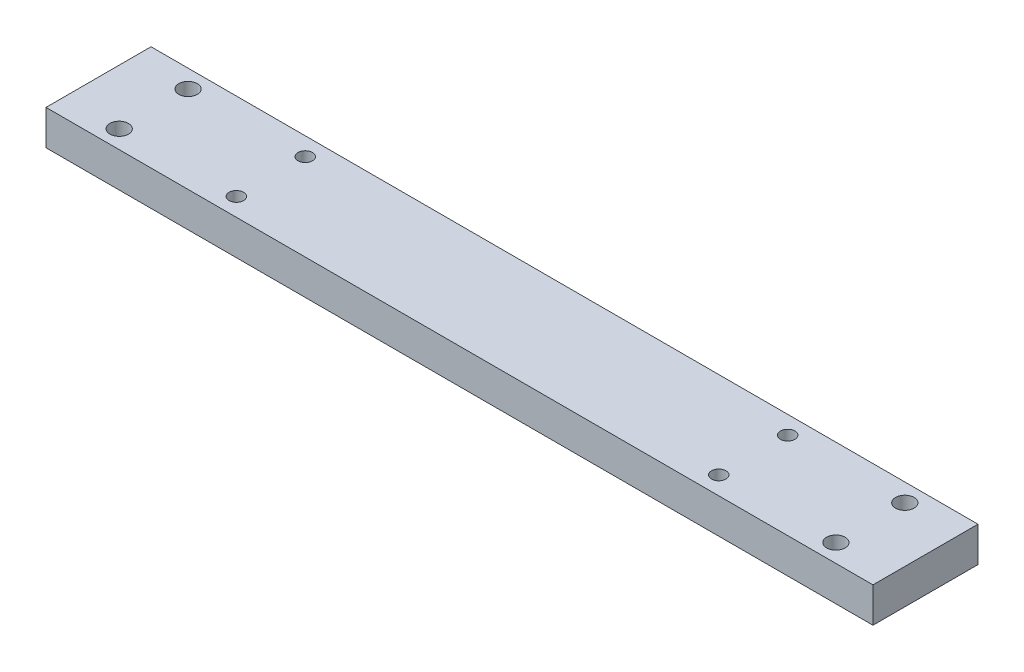
ISO-10303-21;
HEADER;
FILE_DESCRIPTION(('STEP AP214'),'2;1');
FILE_NAME('part.step','',(''),(''),'','','');
FILE_SCHEMA(('AUTOMOTIVE_DESIGN { 1 0 10303 214 1 1 1 1 }'));
ENDSEC;
DATA;
#1=APPLICATION_CONTEXT('core data for automotive mechanical design processes');
#2=APPLICATION_PROTOCOL_DEFINITION('international standard','automotive_design',2000,#1);
#3=PRODUCT_CONTEXT('',#1,'mechanical');
#4=PRODUCT('Part','Part','',(#3));
#5=PRODUCT_RELATED_PRODUCT_CATEGORY('part','',(#4));
#6=PRODUCT_DEFINITION_FORMATION('','',#4);
#7=PRODUCT_DEFINITION_CONTEXT('part definition',#1,'design');
#8=PRODUCT_DEFINITION('design','',#6,#7);
#9=PRODUCT_DEFINITION_SHAPE('','',#8);
#10=(LENGTH_UNIT() NAMED_UNIT(*) SI_UNIT(.MILLI.,.METRE.));
#11=(NAMED_UNIT(*) PLANE_ANGLE_UNIT() SI_UNIT($,.RADIAN.));
#12=(NAMED_UNIT(*) SI_UNIT($,.STERADIAN.) SOLID_ANGLE_UNIT());
#13=UNCERTAINTY_MEASURE_WITH_UNIT(LENGTH_MEASURE(1.E-05),#10,'distance_accuracy_value','');
#14=(GEOMETRIC_REPRESENTATION_CONTEXT(3) GLOBAL_UNCERTAINTY_ASSIGNED_CONTEXT((#13)) GLOBAL_UNIT_ASSIGNED_CONTEXT((#10,
#11,#12)) REPRESENTATION_CONTEXT('',''));
#15=CARTESIAN_POINT('',(0.,0.,0.));
#16=DIRECTION('',(0.,0.,1.));
#17=DIRECTION('',(1.,0.,0.));
#18=AXIS2_PLACEMENT_3D('',#15,#16,#17);
#19=CARTESIAN_POINT('',(0.,25.4,0.));
#20=DIRECTION('',(1.,0.,0.));
#21=DIRECTION('',(0.,0.,-1.));
#22=AXIS2_PLACEMENT_3D('',#19,#20,#21);
#23=PLANE('',#22);
#24=DIRECTION('',(0.,0.,1.));
#25=VECTOR('',#24,1.);
#26=CARTESIAN_POINT('',(0.,0.,0.));
#27=LINE('',#26,#25);
#28=CARTESIAN_POINT('',(0.,0.,-76.2));
#29=VERTEX_POINT('',#28);
#30=CARTESIAN_POINT('',(0.,0.,0.));
#31=VERTEX_POINT('',#30);
#32=EDGE_CURVE('E96',#29,#31,#27,.T.);
#33=ORIENTED_EDGE('',*,*,#32,.T.);
#34=DIRECTION('',(0.,-1.,0.));
#35=VECTOR('',#34,1.);
#36=CARTESIAN_POINT('',(0.,25.4,0.));
#37=LINE('',#36,#35);
#38=CARTESIAN_POINT('',(0.,25.4,0.));
#39=VERTEX_POINT('',#38);
#40=EDGE_CURVE('E11',#39,#31,#37,.T.);
#41=ORIENTED_EDGE('',*,*,#40,.F.);
#42=DIRECTION('',(0.,0.,1.));
#43=VECTOR('',#42,1.);
#44=CARTESIAN_POINT('',(0.,25.4,0.));
#45=LINE('',#44,#43);
#46=CARTESIAN_POINT('',(0.,25.4,-76.2));
#47=VERTEX_POINT('',#46);
#48=EDGE_CURVE('E84',#47,#39,#45,.T.);
#49=ORIENTED_EDGE('',*,*,#48,.F.);
#50=DIRECTION('',(0.,-1.,0.));
#51=VECTOR('',#50,1.);
#52=CARTESIAN_POINT('',(0.,25.4,-76.2));
#53=LINE('',#52,#51);
#54=EDGE_CURVE('E92',#47,#29,#53,.T.);
#55=ORIENTED_EDGE('',*,*,#54,.T.);
#56=EDGE_LOOP('',(#33,#41,#49,#55));
#57=FACE_BOUND('',#56,.T.);
#58=ADVANCED_FACE('F33',(#57),#23,.F.);
#59=CARTESIAN_POINT('',(0.,25.4,0.));
#60=DIRECTION('',(0.,0.,-1.));
#61=DIRECTION('',(-1.,0.,0.));
#62=AXIS2_PLACEMENT_3D('',#59,#60,#61);
#63=PLANE('',#62);
#64=DIRECTION('',(1.,0.,0.));
#65=VECTOR('',#64,1.);
#66=CARTESIAN_POINT('',(0.,0.,0.));
#67=LINE('',#66,#65);
#68=CARTESIAN_POINT('',(600.,0.,0.));
#69=VERTEX_POINT('',#68);
#70=EDGE_CURVE('E88',#31,#69,#67,.T.);
#71=ORIENTED_EDGE('',*,*,#70,.T.);
#72=DIRECTION('',(0.,-1.,0.));
#73=VECTOR('',#72,1.);
#74=CARTESIAN_POINT('',(600.,25.4,0.));
#75=LINE('',#74,#73);
#76=CARTESIAN_POINT('',(600.,25.4,0.));
#77=VERTEX_POINT('',#76);
#78=EDGE_CURVE('E41',#77,#69,#75,.T.);
#79=ORIENTED_EDGE('',*,*,#78,.F.);
#80=DIRECTION('',(1.,0.,0.));
#81=VECTOR('',#80,1.);
#82=CARTESIAN_POINT('',(0.,25.4,0.));
#83=LINE('',#82,#81);
#84=EDGE_CURVE('E79',#39,#77,#83,.T.);
#85=ORIENTED_EDGE('',*,*,#84,.F.);
#86=ORIENTED_EDGE('',*,*,#40,.T.);
#87=EDGE_LOOP('',(#71,#79,#85,#86));
#88=FACE_BOUND('',#87,.T.);
#89=ADVANCED_FACE('F87',(#88),#63,.F.);
#90=CARTESIAN_POINT('',(600.,25.4,0.));
#91=DIRECTION('',(-1.,0.,0.));
#92=DIRECTION('',(0.,0.,1.));
#93=AXIS2_PLACEMENT_3D('',#90,#91,#92);
#94=PLANE('',#93);
#95=DIRECTION('',(0.,0.,-1.));
#96=VECTOR('',#95,1.);
#97=CARTESIAN_POINT('',(600.,0.,0.));
#98=LINE('',#97,#96);
#99=CARTESIAN_POINT('',(600.,0.,-76.2));
#100=VERTEX_POINT('',#99);
#101=EDGE_CURVE('E66',#69,#100,#98,.T.);
#102=ORIENTED_EDGE('',*,*,#101,.T.);
#103=DIRECTION('',(0.,-1.,0.));
#104=VECTOR('',#103,1.);
#105=CARTESIAN_POINT('',(600.,25.4,-76.2));
#106=LINE('',#105,#104);
#107=CARTESIAN_POINT('',(600.,25.4,-76.2));
#108=VERTEX_POINT('',#107);
#109=EDGE_CURVE('E89',#108,#100,#106,.T.);
#110=ORIENTED_EDGE('',*,*,#109,.F.);
#111=DIRECTION('',(0.,0.,-1.));
#112=VECTOR('',#111,1.);
#113=CARTESIAN_POINT('',(600.,25.4,0.));
#114=LINE('',#113,#112);
#115=EDGE_CURVE('E82',#77,#108,#114,.T.);
#116=ORIENTED_EDGE('',*,*,#115,.F.);
#117=ORIENTED_EDGE('',*,*,#78,.T.);
#118=EDGE_LOOP('',(#102,#110,#116,#117));
#119=FACE_BOUND('',#118,.T.);
#120=ADVANCED_FACE('F90',(#119),#94,.F.);
#121=CARTESIAN_POINT('',(0.,25.4,-76.2));
#122=DIRECTION('',(0.,0.,1.));
#123=DIRECTION('',(1.,0.,0.));
#124=AXIS2_PLACEMENT_3D('',#121,#122,#123);
#125=PLANE('',#124);
#126=DIRECTION('',(-1.,0.,0.));
#127=VECTOR('',#126,1.);
#128=CARTESIAN_POINT('',(0.,0.,-76.2));
#129=LINE('',#128,#127);
#130=EDGE_CURVE('E72',#100,#29,#129,.T.);
#131=ORIENTED_EDGE('',*,*,#130,.T.);
#132=ORIENTED_EDGE('',*,*,#54,.F.);
#133=DIRECTION('',(-1.,0.,0.));
#134=VECTOR('',#133,1.);
#135=CARTESIAN_POINT('',(0.,25.4,-76.2));
#136=LINE('',#135,#134);
#137=EDGE_CURVE('E49',#108,#47,#136,.T.);
#138=ORIENTED_EDGE('',*,*,#137,.F.);
#139=ORIENTED_EDGE('',*,*,#109,.T.);
#140=EDGE_LOOP('',(#131,#132,#138,#139));
#141=FACE_BOUND('',#140,.T.);
#142=ADVANCED_FACE('F104',(#141),#125,.F.);
#143=CARTESIAN_POINT('',(0.,25.4,-76.2));
#144=DIRECTION('',(0.,-1.,0.));
#145=DIRECTION('',(0.,0.,-1.));
#146=AXIS2_PLACEMENT_3D('',#143,#144,#145);
#147=PLANE('',#146);
#148=CARTESIAN_POINT('',(475.,25.4,-63.1));
#149=DIRECTION('',(0.,1.,0.));
#150=DIRECTION('',(0.,0.,1.));
#151=AXIS2_PLACEMENT_3D('',#148,#149,#150);
#152=CIRCLE('',#151,5.25);
#153=CARTESIAN_POINT('',(475.,25.4,-57.85));
#154=VERTEX_POINT('',#153);
#155=EDGE_CURVE('E149',#154,#154,#152,.T.);
#156=ORIENTED_EDGE('',*,*,#155,.F.);
#157=EDGE_LOOP('',(#156));
#158=FACE_BOUND('',#157,.T.);
#159=CARTESIAN_POINT('',(475.,25.4,-13.1));
#160=DIRECTION('',(0.,1.,0.));
#161=DIRECTION('',(0.,0.,1.));
#162=AXIS2_PLACEMENT_3D('',#159,#160,#161);
#163=CIRCLE('',#162,5.25000000000001);
#164=CARTESIAN_POINT('',(475.,25.4,-7.84999999999999));
#165=VERTEX_POINT('',#164);
#166=EDGE_CURVE('E143',#165,#165,#163,.T.);
#167=ORIENTED_EDGE('',*,*,#166,.F.);
#168=EDGE_LOOP('',(#167));
#169=FACE_BOUND('',#168,.T.);
#170=CARTESIAN_POINT('',(125.,25.4,-13.1));
#171=DIRECTION('',(0.,1.,0.));
#172=DIRECTION('',(0.,0.,1.));
#173=AXIS2_PLACEMENT_3D('',#170,#171,#172);
#174=CIRCLE('',#173,5.25);
#175=CARTESIAN_POINT('',(125.,25.4,-7.84999999999999));
#176=VERTEX_POINT('',#175);
#177=EDGE_CURVE('E137',#176,#176,#174,.T.);
#178=ORIENTED_EDGE('',*,*,#177,.F.);
#179=EDGE_LOOP('',(#178));
#180=FACE_BOUND('',#179,.T.);
#181=CARTESIAN_POINT('',(125.,25.4,-63.1));
#182=DIRECTION('',(0.,1.,0.));
#183=DIRECTION('',(0.,0.,1.));
#184=AXIS2_PLACEMENT_3D('',#181,#182,#183);
#185=CIRCLE('',#184,5.25000000000003);
#186=CARTESIAN_POINT('',(125.,25.4,-57.85));
#187=VERTEX_POINT('',#186);
#188=EDGE_CURVE('E134',#187,#187,#185,.T.);
#189=ORIENTED_EDGE('',*,*,#188,.F.);
#190=EDGE_LOOP('',(#189));
#191=FACE_BOUND('',#190,.T.);
#192=CARTESIAN_POINT('',(39.9999999999999,25.4,-63.1));
#193=DIRECTION('',(0.,1.,0.));
#194=DIRECTION('',(0.,0.,1.));
#195=AXIS2_PLACEMENT_3D('',#192,#193,#194);
#196=CIRCLE('',#195,6.75);
#197=CARTESIAN_POINT('',(39.9999999999999,25.4,-56.35));
#198=VERTEX_POINT('',#197);
#199=EDGE_CURVE('E125',#198,#198,#196,.T.);
#200=ORIENTED_EDGE('',*,*,#199,.F.);
#201=EDGE_LOOP('',(#200));
#202=FACE_BOUND('',#201,.T.);
#203=CARTESIAN_POINT('',(39.9999999999999,25.4,-13.1));
#204=DIRECTION('',(0.,1.,0.));
#205=DIRECTION('',(0.,0.,1.));
#206=AXIS2_PLACEMENT_3D('',#203,#204,#205);
#207=CIRCLE('',#206,6.75);
#208=CARTESIAN_POINT('',(39.9999999999999,25.4,-6.34999999999997));
#209=VERTEX_POINT('',#208);
#210=EDGE_CURVE('E119',#209,#209,#207,.T.);
#211=ORIENTED_EDGE('',*,*,#210,.F.);
#212=EDGE_LOOP('',(#211));
#213=FACE_BOUND('',#212,.T.);
#214=CARTESIAN_POINT('',(560.,25.4,-63.1));
#215=DIRECTION('',(0.,1.,0.));
#216=DIRECTION('',(0.,0.,1.));
#217=AXIS2_PLACEMENT_3D('',#214,#215,#216);
#218=CIRCLE('',#217,6.75000000000003);
#219=CARTESIAN_POINT('',(560.,25.4,-56.35));
#220=VERTEX_POINT('',#219);
#221=EDGE_CURVE('E113',#220,#220,#218,.T.);
#222=ORIENTED_EDGE('',*,*,#221,.F.);
#223=EDGE_LOOP('',(#222));
#224=FACE_BOUND('',#223,.T.);
#225=CARTESIAN_POINT('',(560.,25.4,-13.1));
#226=DIRECTION('',(0.,1.,0.));
#227=DIRECTION('',(0.,0.,1.));
#228=AXIS2_PLACEMENT_3D('',#225,#226,#227);
#229=CIRCLE('',#228,6.75000000000003);
#230=CARTESIAN_POINT('',(560.,25.4,-6.34999999999997));
#231=VERTEX_POINT('',#230);
#232=EDGE_CURVE('E110',#231,#231,#229,.T.);
#233=ORIENTED_EDGE('',*,*,#232,.F.);
#234=EDGE_LOOP('',(#233));
#235=FACE_BOUND('',#234,.T.);
#236=ORIENTED_EDGE('',*,*,#48,.T.);
#237=ORIENTED_EDGE('',*,*,#84,.T.);
#238=ORIENTED_EDGE('',*,*,#115,.T.);
#239=ORIENTED_EDGE('',*,*,#137,.T.);
#240=EDGE_LOOP('',(#236,#237,#238,#239));
#241=FACE_BOUND('',#240,.T.);
#242=ADVANCED_FACE('F80',(#158,#169,#180,#191,#202,#213,#224,#235,#241),#147,.F.);
#243=CARTESIAN_POINT('',(0.,0.,-76.2));
#244=DIRECTION('',(0.,-1.,0.));
#245=DIRECTION('',(0.,0.,-1.));
#246=AXIS2_PLACEMENT_3D('',#243,#244,#245);
#247=PLANE('',#246);
#248=CARTESIAN_POINT('',(475.,0.,-63.1));
#249=DIRECTION('',(0.,1.,0.));
#250=DIRECTION('',(0.,0.,1.));
#251=AXIS2_PLACEMENT_3D('',#248,#249,#250);
#252=CIRCLE('',#251,5.25);
#253=CARTESIAN_POINT('',(475.,0.,-57.85));
#254=VERTEX_POINT('',#253);
#255=EDGE_CURVE('E152',#254,#254,#252,.T.);
#256=ORIENTED_EDGE('',*,*,#255,.T.);
#257=EDGE_LOOP('',(#256));
#258=FACE_BOUND('',#257,.T.);
#259=CARTESIAN_POINT('',(475.,0.,-13.1));
#260=DIRECTION('',(0.,1.,0.));
#261=DIRECTION('',(0.,0.,1.));
#262=AXIS2_PLACEMENT_3D('',#259,#260,#261);
#263=CIRCLE('',#262,5.25000000000001);
#264=CARTESIAN_POINT('',(475.,0.,-7.84999999999999));
#265=VERTEX_POINT('',#264);
#266=EDGE_CURVE('E146',#265,#265,#263,.T.);
#267=ORIENTED_EDGE('',*,*,#266,.T.);
#268=EDGE_LOOP('',(#267));
#269=FACE_BOUND('',#268,.T.);
#270=CARTESIAN_POINT('',(125.,0.,-13.1));
#271=DIRECTION('',(0.,1.,0.));
#272=DIRECTION('',(0.,0.,1.));
#273=AXIS2_PLACEMENT_3D('',#270,#271,#272);
#274=CIRCLE('',#273,5.25);
#275=CARTESIAN_POINT('',(125.,0.,-7.84999999999999));
#276=VERTEX_POINT('',#275);
#277=EDGE_CURVE('E140',#276,#276,#274,.T.);
#278=ORIENTED_EDGE('',*,*,#277,.T.);
#279=EDGE_LOOP('',(#278));
#280=FACE_BOUND('',#279,.T.);
#281=CARTESIAN_POINT('',(125.,0.,-63.1));
#282=DIRECTION('',(0.,1.,0.));
#283=DIRECTION('',(0.,0.,1.));
#284=AXIS2_PLACEMENT_3D('',#281,#282,#283);
#285=CIRCLE('',#284,5.25000000000003);
#286=CARTESIAN_POINT('',(125.,0.,-57.85));
#287=VERTEX_POINT('',#286);
#288=EDGE_CURVE('E131',#287,#287,#285,.T.);
#289=ORIENTED_EDGE('',*,*,#288,.T.);
#290=EDGE_LOOP('',(#289));
#291=FACE_BOUND('',#290,.T.);
#292=CARTESIAN_POINT('',(39.9999999999999,0.,-63.1));
#293=DIRECTION('',(0.,1.,0.));
#294=DIRECTION('',(0.,0.,1.));
#295=AXIS2_PLACEMENT_3D('',#292,#293,#294);
#296=CIRCLE('',#295,6.75);
#297=CARTESIAN_POINT('',(39.9999999999999,0.,-56.35));
#298=VERTEX_POINT('',#297);
#299=EDGE_CURVE('E128',#298,#298,#296,.T.);
#300=ORIENTED_EDGE('',*,*,#299,.T.);
#301=EDGE_LOOP('',(#300));
#302=FACE_BOUND('',#301,.T.);
#303=CARTESIAN_POINT('',(39.9999999999999,0.,-13.1));
#304=DIRECTION('',(0.,1.,0.));
#305=DIRECTION('',(0.,0.,1.));
#306=AXIS2_PLACEMENT_3D('',#303,#304,#305);
#307=CIRCLE('',#306,6.75);
#308=CARTESIAN_POINT('',(39.9999999999999,0.,-6.34999999999997));
#309=VERTEX_POINT('',#308);
#310=EDGE_CURVE('E122',#309,#309,#307,.T.);
#311=ORIENTED_EDGE('',*,*,#310,.T.);
#312=EDGE_LOOP('',(#311));
#313=FACE_BOUND('',#312,.T.);
#314=CARTESIAN_POINT('',(560.,0.,-63.1));
#315=DIRECTION('',(0.,1.,0.));
#316=DIRECTION('',(0.,0.,1.));
#317=AXIS2_PLACEMENT_3D('',#314,#315,#316);
#318=CIRCLE('',#317,6.75000000000003);
#319=CARTESIAN_POINT('',(560.,0.,-56.35));
#320=VERTEX_POINT('',#319);
#321=EDGE_CURVE('E116',#320,#320,#318,.T.);
#322=ORIENTED_EDGE('',*,*,#321,.T.);
#323=EDGE_LOOP('',(#322));
#324=FACE_BOUND('',#323,.T.);
#325=CARTESIAN_POINT('',(560.,0.,-13.1));
#326=DIRECTION('',(0.,1.,0.));
#327=DIRECTION('',(0.,0.,1.));
#328=AXIS2_PLACEMENT_3D('',#325,#326,#327);
#329=CIRCLE('',#328,6.75000000000003);
#330=CARTESIAN_POINT('',(560.,0.,-6.34999999999997));
#331=VERTEX_POINT('',#330);
#332=EDGE_CURVE('E99',#331,#331,#329,.T.);
#333=ORIENTED_EDGE('',*,*,#332,.T.);
#334=EDGE_LOOP('',(#333));
#335=FACE_BOUND('',#334,.T.);
#336=ORIENTED_EDGE('',*,*,#32,.F.);
#337=ORIENTED_EDGE('',*,*,#130,.F.);
#338=ORIENTED_EDGE('',*,*,#101,.F.);
#339=ORIENTED_EDGE('',*,*,#70,.F.);
#340=EDGE_LOOP('',(#336,#337,#338,#339));
#341=FACE_BOUND('',#340,.T.);
#342=ADVANCED_FACE('F107',(#258,#269,#280,#291,#302,#313,#324,#335,#341),#247,.T.);
#343=CARTESIAN_POINT('',(560.,0.,-13.1));
#344=DIRECTION('',(0.,1.,0.));
#345=DIRECTION('',(0.,0.,1.));
#346=AXIS2_PLACEMENT_3D('',#343,#344,#345);
#347=CYLINDRICAL_SURFACE('',#346,6.75000000000003);
#348=ORIENTED_EDGE('',*,*,#332,.F.);
#349=EDGE_LOOP('',(#348));
#350=FACE_BOUND('',#349,.T.);
#351=ORIENTED_EDGE('',*,*,#232,.T.);
#352=EDGE_LOOP('',(#351));
#353=FACE_BOUND('',#352,.T.);
#354=ADVANCED_FACE('F177',(#350,#353),#347,.F.);
#355=CARTESIAN_POINT('',(560.,0.,-63.1));
#356=DIRECTION('',(0.,1.,0.));
#357=DIRECTION('',(0.,0.,1.));
#358=AXIS2_PLACEMENT_3D('',#355,#356,#357);
#359=CYLINDRICAL_SURFACE('',#358,6.75000000000003);
#360=ORIENTED_EDGE('',*,*,#321,.F.);
#361=EDGE_LOOP('',(#360));
#362=FACE_BOUND('',#361,.T.);
#363=ORIENTED_EDGE('',*,*,#221,.T.);
#364=EDGE_LOOP('',(#363));
#365=FACE_BOUND('',#364,.T.);
#366=ADVANCED_FACE('F179',(#362,#365),#359,.F.);
#367=CARTESIAN_POINT('',(39.9999999999999,0.,-13.1));
#368=DIRECTION('',(0.,1.,0.));
#369=DIRECTION('',(0.,0.,1.));
#370=AXIS2_PLACEMENT_3D('',#367,#368,#369);
#371=CYLINDRICAL_SURFACE('',#370,6.75);
#372=ORIENTED_EDGE('',*,*,#310,.F.);
#373=EDGE_LOOP('',(#372));
#374=FACE_BOUND('',#373,.T.);
#375=ORIENTED_EDGE('',*,*,#210,.T.);
#376=EDGE_LOOP('',(#375));
#377=FACE_BOUND('',#376,.T.);
#378=ADVANCED_FACE('F186',(#374,#377),#371,.F.);
#379=CARTESIAN_POINT('',(39.9999999999999,0.,-63.1));
#380=DIRECTION('',(0.,1.,0.));
#381=DIRECTION('',(0.,0.,1.));
#382=AXIS2_PLACEMENT_3D('',#379,#380,#381);
#383=CYLINDRICAL_SURFACE('',#382,6.75);
#384=ORIENTED_EDGE('',*,*,#299,.F.);
#385=EDGE_LOOP('',(#384));
#386=FACE_BOUND('',#385,.T.);
#387=ORIENTED_EDGE('',*,*,#199,.T.);
#388=EDGE_LOOP('',(#387));
#389=FACE_BOUND('',#388,.T.);
#390=ADVANCED_FACE('F227',(#386,#389),#383,.F.);
#391=CARTESIAN_POINT('',(125.,0.,-63.1));
#392=DIRECTION('',(0.,1.,0.));
#393=DIRECTION('',(0.,0.,1.));
#394=AXIS2_PLACEMENT_3D('',#391,#392,#393);
#395=CYLINDRICAL_SURFACE('',#394,5.25000000000003);
#396=ORIENTED_EDGE('',*,*,#288,.F.);
#397=EDGE_LOOP('',(#396));
#398=FACE_BOUND('',#397,.T.);
#399=ORIENTED_EDGE('',*,*,#188,.T.);
#400=EDGE_LOOP('',(#399));
#401=FACE_BOUND('',#400,.T.);
#402=ADVANCED_FACE('F221',(#398,#401),#395,.F.);
#403=CARTESIAN_POINT('',(125.,0.,-13.1));
#404=DIRECTION('',(0.,1.,0.));
#405=DIRECTION('',(0.,0.,1.));
#406=AXIS2_PLACEMENT_3D('',#403,#404,#405);
#407=CYLINDRICAL_SURFACE('',#406,5.25);
#408=ORIENTED_EDGE('',*,*,#277,.F.);
#409=EDGE_LOOP('',(#408));
#410=FACE_BOUND('',#409,.T.);
#411=ORIENTED_EDGE('',*,*,#177,.T.);
#412=EDGE_LOOP('',(#411));
#413=FACE_BOUND('',#412,.T.);
#414=ADVANCED_FACE('F226',(#410,#413),#407,.F.);
#415=CARTESIAN_POINT('',(475.,0.,-13.1));
#416=DIRECTION('',(0.,1.,0.));
#417=DIRECTION('',(0.,0.,1.));
#418=AXIS2_PLACEMENT_3D('',#415,#416,#417);
#419=CYLINDRICAL_SURFACE('',#418,5.25000000000001);
#420=ORIENTED_EDGE('',*,*,#266,.F.);
#421=EDGE_LOOP('',(#420));
#422=FACE_BOUND('',#421,.T.);
#423=ORIENTED_EDGE('',*,*,#166,.T.);
#424=EDGE_LOOP('',(#423));
#425=FACE_BOUND('',#424,.T.);
#426=ADVANCED_FACE('F239',(#422,#425),#419,.F.);
#427=CARTESIAN_POINT('',(475.,0.,-63.1));
#428=DIRECTION('',(0.,1.,0.));
#429=DIRECTION('',(0.,0.,1.));
#430=AXIS2_PLACEMENT_3D('',#427,#428,#429);
#431=CYLINDRICAL_SURFACE('',#430,5.25);
#432=ORIENTED_EDGE('',*,*,#255,.F.);
#433=EDGE_LOOP('',(#432));
#434=FACE_BOUND('',#433,.T.);
#435=ORIENTED_EDGE('',*,*,#155,.T.);
#436=EDGE_LOOP('',(#435));
#437=FACE_BOUND('',#436,.T.);
#438=ADVANCED_FACE('F158',(#434,#437),#431,.F.);
#439=CLOSED_SHELL('',(#58,#89,#120,#142,#242,#342,#354,#366,#378,#390,#402,#414,#426,#438));
#440=MANIFOLD_SOLID_BREP('B2',#439);
#441=ADVANCED_BREP_SHAPE_REPRESENTATION('',(#18,#440),#14);
#442=SHAPE_DEFINITION_REPRESENTATION(#9,#441);
ENDSEC;
END-ISO-10303-21;
